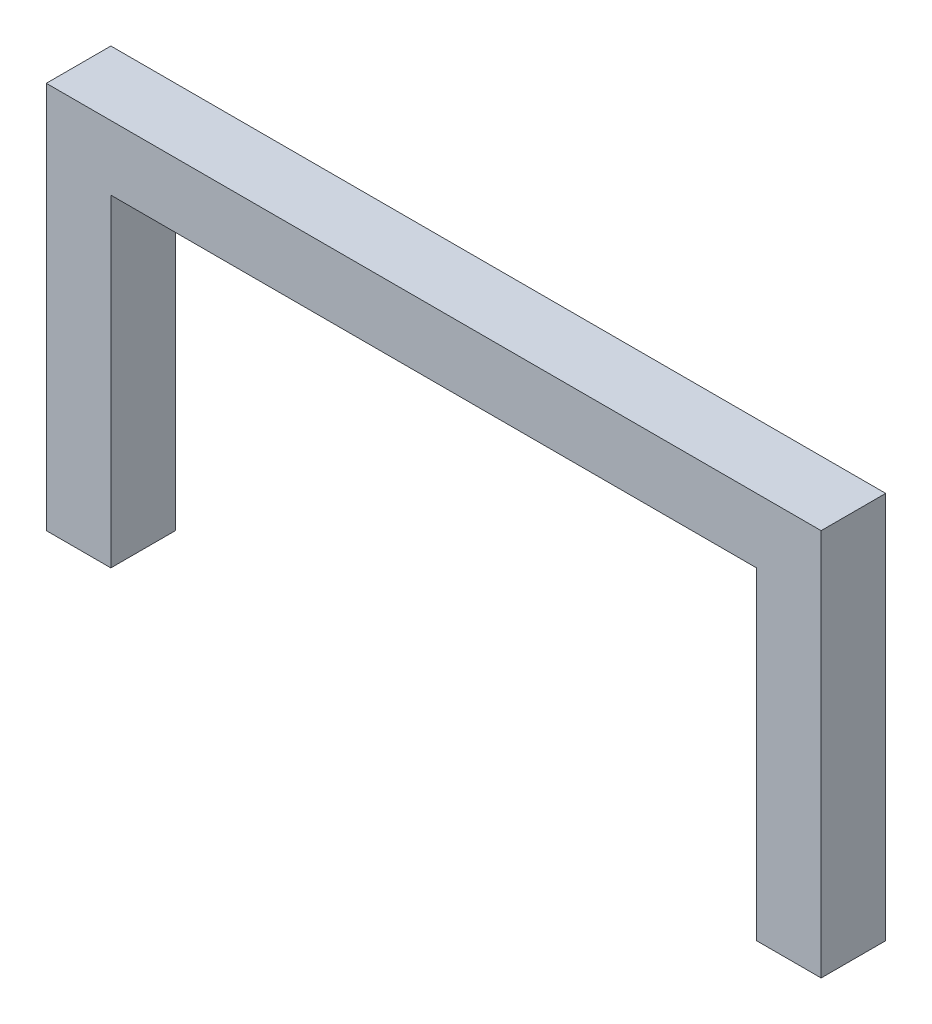
ISO-10303-21;
HEADER;
FILE_DESCRIPTION(('STEP AP214'),'2;1');
FILE_NAME('part.step','',(''),(''),'','','');
FILE_SCHEMA(('AUTOMOTIVE_DESIGN { 1 0 10303 214 1 1 1 1 }'));
ENDSEC;
DATA;
#1=APPLICATION_CONTEXT('core data for automotive mechanical design processes');
#2=APPLICATION_PROTOCOL_DEFINITION('international standard','automotive_design',2000,#1);
#3=PRODUCT_CONTEXT('',#1,'mechanical');
#4=PRODUCT('Part','Part','',(#3));
#5=PRODUCT_RELATED_PRODUCT_CATEGORY('part','',(#4));
#6=PRODUCT_DEFINITION_FORMATION('','',#4);
#7=PRODUCT_DEFINITION_CONTEXT('part definition',#1,'design');
#8=PRODUCT_DEFINITION('design','',#6,#7);
#9=PRODUCT_DEFINITION_SHAPE('','',#8);
#10=(LENGTH_UNIT() NAMED_UNIT(*) SI_UNIT(.MILLI.,.METRE.));
#11=(NAMED_UNIT(*) PLANE_ANGLE_UNIT() SI_UNIT($,.RADIAN.));
#12=(NAMED_UNIT(*) SI_UNIT($,.STERADIAN.) SOLID_ANGLE_UNIT());
#13=UNCERTAINTY_MEASURE_WITH_UNIT(LENGTH_MEASURE(1.E-05),#10,'distance_accuracy_value','');
#14=(GEOMETRIC_REPRESENTATION_CONTEXT(3) GLOBAL_UNCERTAINTY_ASSIGNED_CONTEXT((#13)) GLOBAL_UNIT_ASSIGNED_CONTEXT((#10,
#11,#12)) REPRESENTATION_CONTEXT('',''));
#15=CARTESIAN_POINT('',(0.,0.,0.));
#16=DIRECTION('',(0.,0.,1.));
#17=DIRECTION('',(1.,0.,0.));
#18=AXIS2_PLACEMENT_3D('',#15,#16,#17);
#19=CARTESIAN_POINT('',(-3.175,0.,3.175));
#20=DIRECTION('',(0.,1.,0.));
#21=DIRECTION('',(0.,0.,1.));
#22=AXIS2_PLACEMENT_3D('',#19,#20,#21);
#23=PLANE('',#22);
#24=DIRECTION('',(1.,0.,0.));
#25=VECTOR('',#24,1.);
#26=CARTESIAN_POINT('',(-3.175,0.,0.));
#27=LINE('',#26,#25);
#28=CARTESIAN_POINT('',(-3.175,0.,0.));
#29=VERTEX_POINT('',#28);
#30=CARTESIAN_POINT('',(0.,0.,0.));
#31=VERTEX_POINT('',#30);
#32=EDGE_CURVE('E146',#29,#31,#27,.T.);
#33=ORIENTED_EDGE('',*,*,#32,.T.);
#34=DIRECTION('',(0.,0.,-1.));
#35=VECTOR('',#34,1.);
#36=CARTESIAN_POINT('',(0.,0.,3.175));
#37=LINE('',#36,#35);
#38=CARTESIAN_POINT('',(0.,0.,3.175));
#39=VERTEX_POINT('',#38);
#40=EDGE_CURVE('E11',#39,#31,#37,.T.);
#41=ORIENTED_EDGE('',*,*,#40,.F.);
#42=DIRECTION('',(1.,0.,0.));
#43=VECTOR('',#42,1.);
#44=CARTESIAN_POINT('',(-3.175,0.,3.175));
#45=LINE('',#44,#43);
#46=CARTESIAN_POINT('',(-3.175,0.,3.175));
#47=VERTEX_POINT('',#46);
#48=EDGE_CURVE('E172',#47,#39,#45,.T.);
#49=ORIENTED_EDGE('',*,*,#48,.F.);
#50=DIRECTION('',(0.,0.,-1.));
#51=VECTOR('',#50,1.);
#52=CARTESIAN_POINT('',(-3.175,0.,3.175));
#53=LINE('',#52,#51);
#54=EDGE_CURVE('E60',#47,#29,#53,.T.);
#55=ORIENTED_EDGE('',*,*,#54,.T.);
#56=EDGE_LOOP('',(#33,#41,#49,#55));
#57=FACE_BOUND('',#56,.T.);
#58=ADVANCED_FACE('F43',(#57),#23,.F.);
#59=CARTESIAN_POINT('',(0.,0.,3.175));
#60=DIRECTION('',(-1.,0.,0.));
#61=DIRECTION('',(0.,0.,1.));
#62=AXIS2_PLACEMENT_3D('',#59,#60,#61);
#63=PLANE('',#62);
#64=DIRECTION('',(0.,1.,0.));
#65=VECTOR('',#64,1.);
#66=CARTESIAN_POINT('',(0.,0.,0.));
#67=LINE('',#66,#65);
#68=CARTESIAN_POINT('',(0.,15.875,0.));
#69=VERTEX_POINT('',#68);
#70=EDGE_CURVE('E149',#31,#69,#67,.T.);
#71=ORIENTED_EDGE('',*,*,#70,.T.);
#72=DIRECTION('',(0.,0.,-1.));
#73=VECTOR('',#72,1.);
#74=CARTESIAN_POINT('',(0.,15.875,3.175));
#75=LINE('',#74,#73);
#76=CARTESIAN_POINT('',(0.,15.875,3.175));
#77=VERTEX_POINT('',#76);
#78=EDGE_CURVE('E52',#77,#69,#75,.T.);
#79=ORIENTED_EDGE('',*,*,#78,.F.);
#80=DIRECTION('',(0.,1.,0.));
#81=VECTOR('',#80,1.);
#82=CARTESIAN_POINT('',(0.,0.,3.175));
#83=LINE('',#82,#81);
#84=EDGE_CURVE('E98',#39,#77,#83,.T.);
#85=ORIENTED_EDGE('',*,*,#84,.F.);
#86=ORIENTED_EDGE('',*,*,#40,.T.);
#87=EDGE_LOOP('',(#71,#79,#85,#86));
#88=FACE_BOUND('',#87,.T.);
#89=ADVANCED_FACE('F210',(#88),#63,.F.);
#90=CARTESIAN_POINT('',(0.,15.875,3.175));
#91=DIRECTION('',(0.,1.,0.));
#92=DIRECTION('',(-1.,0.,0.));
#93=AXIS2_PLACEMENT_3D('',#90,#91,#92);
#94=PLANE('',#93);
#95=DIRECTION('',(1.,0.,0.));
#96=VECTOR('',#95,1.);
#97=CARTESIAN_POINT('',(0.,15.875,0.));
#98=LINE('',#97,#96);
#99=CARTESIAN_POINT('',(31.75,15.875,0.));
#100=VERTEX_POINT('',#99);
#101=EDGE_CURVE('E152',#69,#100,#98,.T.);
#102=ORIENTED_EDGE('',*,*,#101,.T.);
#103=DIRECTION('',(0.,0.,-1.));
#104=VECTOR('',#103,1.);
#105=CARTESIAN_POINT('',(31.75,15.875,3.175));
#106=LINE('',#105,#104);
#107=CARTESIAN_POINT('',(31.75,15.875,3.175));
#108=VERTEX_POINT('',#107);
#109=EDGE_CURVE('E182',#108,#100,#106,.T.);
#110=ORIENTED_EDGE('',*,*,#109,.F.);
#111=DIRECTION('',(1.,0.,0.));
#112=VECTOR('',#111,1.);
#113=CARTESIAN_POINT('',(0.,15.875,3.175));
#114=LINE('',#113,#112);
#115=EDGE_CURVE('E191',#77,#108,#114,.T.);
#116=ORIENTED_EDGE('',*,*,#115,.F.);
#117=ORIENTED_EDGE('',*,*,#78,.T.);
#118=EDGE_LOOP('',(#102,#110,#116,#117));
#119=FACE_BOUND('',#118,.T.);
#120=ADVANCED_FACE('F189',(#119),#94,.F.);
#121=CARTESIAN_POINT('',(31.75,0.,3.175));
#122=DIRECTION('',(-1.,0.,0.));
#123=DIRECTION('',(0.,0.,1.));
#124=AXIS2_PLACEMENT_3D('',#121,#122,#123);
#125=PLANE('',#124);
#126=DIRECTION('',(0.,1.,0.));
#127=VECTOR('',#126,1.);
#128=CARTESIAN_POINT('',(31.75,0.,0.));
#129=LINE('',#128,#127);
#130=CARTESIAN_POINT('',(31.75,0.,0.));
#131=VERTEX_POINT('',#130);
#132=EDGE_CURVE('E156',#131,#100,#129,.T.);
#133=ORIENTED_EDGE('',*,*,#132,.F.);
#134=DIRECTION('',(0.,0.,-1.));
#135=VECTOR('',#134,1.);
#136=CARTESIAN_POINT('',(31.75,0.,3.175));
#137=LINE('',#136,#135);
#138=CARTESIAN_POINT('',(31.75,0.,3.175));
#139=VERTEX_POINT('',#138);
#140=EDGE_CURVE('E179',#139,#131,#137,.T.);
#141=ORIENTED_EDGE('',*,*,#140,.F.);
#142=DIRECTION('',(0.,1.,0.));
#143=VECTOR('',#142,1.);
#144=CARTESIAN_POINT('',(31.75,0.,3.175));
#145=LINE('',#144,#143);
#146=EDGE_CURVE('E199',#139,#108,#145,.T.);
#147=ORIENTED_EDGE('',*,*,#146,.T.);
#148=ORIENTED_EDGE('',*,*,#109,.T.);
#149=EDGE_LOOP('',(#133,#141,#147,#148));
#150=FACE_BOUND('',#149,.T.);
#151=ADVANCED_FACE('F197',(#150),#125,.T.);
#152=CARTESIAN_POINT('',(31.75,0.,3.175));
#153=DIRECTION('',(0.,1.,0.));
#154=DIRECTION('',(0.,0.,1.));
#155=AXIS2_PLACEMENT_3D('',#152,#153,#154);
#156=PLANE('',#155);
#157=DIRECTION('',(1.,0.,0.));
#158=VECTOR('',#157,1.);
#159=CARTESIAN_POINT('',(31.75,0.,0.));
#160=LINE('',#159,#158);
#161=CARTESIAN_POINT('',(34.925,0.,0.));
#162=VERTEX_POINT('',#161);
#163=EDGE_CURVE('E160',#131,#162,#160,.T.);
#164=ORIENTED_EDGE('',*,*,#163,.T.);
#165=DIRECTION('',(0.,0.,-1.));
#166=VECTOR('',#165,1.);
#167=CARTESIAN_POINT('',(34.925,0.,3.175));
#168=LINE('',#167,#166);
#169=CARTESIAN_POINT('',(34.925,0.,3.175));
#170=VERTEX_POINT('',#169);
#171=EDGE_CURVE('E136',#170,#162,#168,.T.);
#172=ORIENTED_EDGE('',*,*,#171,.F.);
#173=DIRECTION('',(1.,0.,0.));
#174=VECTOR('',#173,1.);
#175=CARTESIAN_POINT('',(31.75,0.,3.175));
#176=LINE('',#175,#174);
#177=EDGE_CURVE('E122',#139,#170,#176,.T.);
#178=ORIENTED_EDGE('',*,*,#177,.F.);
#179=ORIENTED_EDGE('',*,*,#140,.T.);
#180=EDGE_LOOP('',(#164,#172,#178,#179));
#181=FACE_BOUND('',#180,.T.);
#182=ADVANCED_FACE('F220',(#181),#156,.F.);
#183=CARTESIAN_POINT('',(34.925,0.,3.175));
#184=DIRECTION('',(-1.,0.,0.));
#185=DIRECTION('',(0.,0.,1.));
#186=AXIS2_PLACEMENT_3D('',#183,#184,#185);
#187=PLANE('',#186);
#188=DIRECTION('',(0.,1.,0.));
#189=VECTOR('',#188,1.);
#190=CARTESIAN_POINT('',(34.925,0.,0.));
#191=LINE('',#190,#189);
#192=CARTESIAN_POINT('',(34.925,19.05,0.));
#193=VERTEX_POINT('',#192);
#194=EDGE_CURVE('E132',#162,#193,#191,.T.);
#195=ORIENTED_EDGE('',*,*,#194,.T.);
#196=DIRECTION('',(0.,0.,-1.));
#197=VECTOR('',#196,1.);
#198=CARTESIAN_POINT('',(34.925,19.05,3.175));
#199=LINE('',#198,#197);
#200=CARTESIAN_POINT('',(34.925,19.05,3.175));
#201=VERTEX_POINT('',#200);
#202=EDGE_CURVE('E129',#201,#193,#199,.T.);
#203=ORIENTED_EDGE('',*,*,#202,.F.);
#204=DIRECTION('',(0.,1.,0.));
#205=VECTOR('',#204,1.);
#206=CARTESIAN_POINT('',(34.925,0.,3.175));
#207=LINE('',#206,#205);
#208=EDGE_CURVE('E114',#170,#201,#207,.T.);
#209=ORIENTED_EDGE('',*,*,#208,.F.);
#210=ORIENTED_EDGE('',*,*,#171,.T.);
#211=EDGE_LOOP('',(#195,#203,#209,#210));
#212=FACE_BOUND('',#211,.T.);
#213=ADVANCED_FACE('F130',(#212),#187,.F.);
#214=CARTESIAN_POINT('',(-3.175,19.05,3.175));
#215=DIRECTION('',(0.,1.,0.));
#216=DIRECTION('',(0.,0.,1.));
#217=AXIS2_PLACEMENT_3D('',#214,#215,#216);
#218=PLANE('',#217);
#219=DIRECTION('',(1.,0.,0.));
#220=VECTOR('',#219,1.);
#221=CARTESIAN_POINT('',(-3.175,19.05,0.));
#222=LINE('',#221,#220);
#223=CARTESIAN_POINT('',(-3.175,19.05,0.));
#224=VERTEX_POINT('',#223);
#225=EDGE_CURVE('E165',#224,#193,#222,.T.);
#226=ORIENTED_EDGE('',*,*,#225,.F.);
#227=DIRECTION('',(0.,0.,-1.));
#228=VECTOR('',#227,1.);
#229=CARTESIAN_POINT('',(-3.175,19.05,3.175));
#230=LINE('',#229,#228);
#231=CARTESIAN_POINT('',(-3.175,19.05,3.175));
#232=VERTEX_POINT('',#231);
#233=EDGE_CURVE('E86',#232,#224,#230,.T.);
#234=ORIENTED_EDGE('',*,*,#233,.F.);
#235=DIRECTION('',(1.,0.,0.));
#236=VECTOR('',#235,1.);
#237=CARTESIAN_POINT('',(-3.175,19.05,3.175));
#238=LINE('',#237,#236);
#239=EDGE_CURVE('E119',#232,#201,#238,.T.);
#240=ORIENTED_EDGE('',*,*,#239,.T.);
#241=ORIENTED_EDGE('',*,*,#202,.T.);
#242=EDGE_LOOP('',(#226,#234,#240,#241));
#243=FACE_BOUND('',#242,.T.);
#244=ADVANCED_FACE('F138',(#243),#218,.T.);
#245=CARTESIAN_POINT('',(-3.175,0.,3.175));
#246=DIRECTION('',(-1.,0.,0.));
#247=DIRECTION('',(0.,0.,1.));
#248=AXIS2_PLACEMENT_3D('',#245,#246,#247);
#249=PLANE('',#248);
#250=DIRECTION('',(0.,1.,0.));
#251=VECTOR('',#250,1.);
#252=CARTESIAN_POINT('',(-3.175,0.,0.));
#253=LINE('',#252,#251);
#254=EDGE_CURVE('E168',#29,#224,#253,.T.);
#255=ORIENTED_EDGE('',*,*,#254,.F.);
#256=ORIENTED_EDGE('',*,*,#54,.F.);
#257=DIRECTION('',(0.,1.,0.));
#258=VECTOR('',#257,1.);
#259=CARTESIAN_POINT('',(-3.175,0.,3.175));
#260=LINE('',#259,#258);
#261=EDGE_CURVE('E140',#47,#232,#260,.T.);
#262=ORIENTED_EDGE('',*,*,#261,.T.);
#263=ORIENTED_EDGE('',*,*,#233,.T.);
#264=EDGE_LOOP('',(#255,#256,#262,#263));
#265=FACE_BOUND('',#264,.T.);
#266=ADVANCED_FACE('F228',(#265),#249,.T.);
#267=CARTESIAN_POINT('',(0.,0.,3.175));
#268=DIRECTION('',(0.,0.,1.));
#269=DIRECTION('',(1.,0.,0.));
#270=AXIS2_PLACEMENT_3D('',#267,#268,#269);
#271=PLANE('',#270);
#272=ORIENTED_EDGE('',*,*,#48,.T.);
#273=ORIENTED_EDGE('',*,*,#84,.T.);
#274=ORIENTED_EDGE('',*,*,#115,.T.);
#275=ORIENTED_EDGE('',*,*,#146,.F.);
#276=ORIENTED_EDGE('',*,*,#177,.T.);
#277=ORIENTED_EDGE('',*,*,#208,.T.);
#278=ORIENTED_EDGE('',*,*,#239,.F.);
#279=ORIENTED_EDGE('',*,*,#261,.F.);
#280=EDGE_LOOP('',(#272,#273,#274,#275,#276,#277,#278,#279));
#281=FACE_BOUND('',#280,.T.);
#282=ADVANCED_FACE('F116',(#281),#271,.T.);
#283=CARTESIAN_POINT('',(0.,0.,0.));
#284=DIRECTION('',(0.,0.,1.));
#285=DIRECTION('',(1.,0.,0.));
#286=AXIS2_PLACEMENT_3D('',#283,#284,#285);
#287=PLANE('',#286);
#288=ORIENTED_EDGE('',*,*,#32,.F.);
#289=ORIENTED_EDGE('',*,*,#254,.T.);
#290=ORIENTED_EDGE('',*,*,#225,.T.);
#291=ORIENTED_EDGE('',*,*,#194,.F.);
#292=ORIENTED_EDGE('',*,*,#163,.F.);
#293=ORIENTED_EDGE('',*,*,#132,.T.);
#294=ORIENTED_EDGE('',*,*,#101,.F.);
#295=ORIENTED_EDGE('',*,*,#70,.F.);
#296=EDGE_LOOP('',(#288,#289,#290,#291,#292,#293,#294,#295));
#297=FACE_BOUND('',#296,.T.);
#298=ADVANCED_FACE('F193',(#297),#287,.F.);
#299=CLOSED_SHELL('',(#58,#89,#120,#151,#182,#213,#244,#266,#282,#298));
#300=MANIFOLD_SOLID_BREP('B2',#299);
#301=ADVANCED_BREP_SHAPE_REPRESENTATION('',(#18,#300),#14);
#302=SHAPE_DEFINITION_REPRESENTATION(#9,#301);
ENDSEC;
END-ISO-10303-21;
